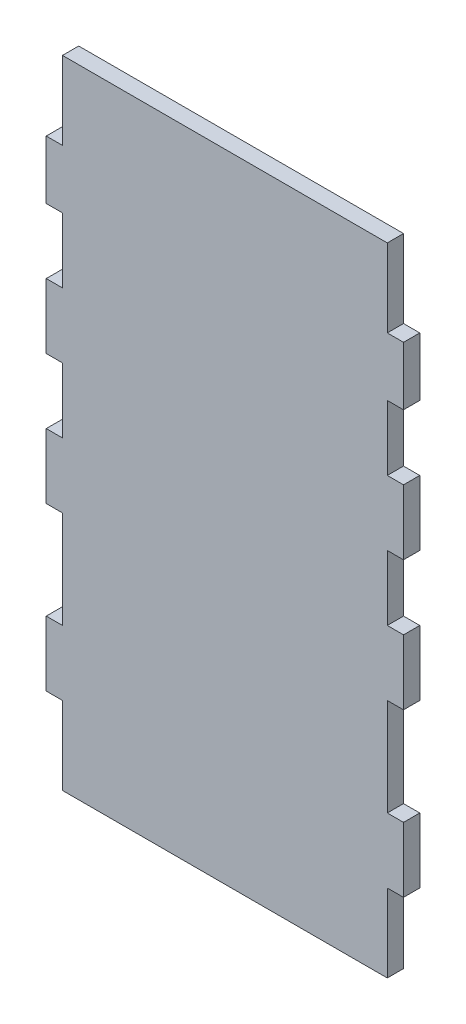
ISO-10303-21;
HEADER;
FILE_DESCRIPTION(('STEP AP214'),'2;1');
FILE_NAME('part.step','',(''),(''),'','','');
FILE_SCHEMA(('AUTOMOTIVE_DESIGN { 1 0 10303 214 1 1 1 1 }'));
ENDSEC;
DATA;
#1=APPLICATION_CONTEXT('core data for automotive mechanical design processes');
#2=APPLICATION_PROTOCOL_DEFINITION('international standard','automotive_design',2000,#1);
#3=PRODUCT_CONTEXT('',#1,'mechanical');
#4=PRODUCT('Part','Part','',(#3));
#5=PRODUCT_RELATED_PRODUCT_CATEGORY('part','',(#4));
#6=PRODUCT_DEFINITION_FORMATION('','',#4);
#7=PRODUCT_DEFINITION_CONTEXT('part definition',#1,'design');
#8=PRODUCT_DEFINITION('design','',#6,#7);
#9=PRODUCT_DEFINITION_SHAPE('','',#8);
#10=(LENGTH_UNIT() NAMED_UNIT(*) SI_UNIT(.MILLI.,.METRE.));
#11=(NAMED_UNIT(*) PLANE_ANGLE_UNIT() SI_UNIT($,.RADIAN.));
#12=(NAMED_UNIT(*) SI_UNIT($,.STERADIAN.) SOLID_ANGLE_UNIT());
#13=UNCERTAINTY_MEASURE_WITH_UNIT(LENGTH_MEASURE(1.E-05),#10,'distance_accuracy_value','');
#14=(GEOMETRIC_REPRESENTATION_CONTEXT(3) GLOBAL_UNCERTAINTY_ASSIGNED_CONTEXT((#13)) GLOBAL_UNIT_ASSIGNED_CONTEXT((#10,
#11,#12)) REPRESENTATION_CONTEXT('',''));
#15=CARTESIAN_POINT('',(0.,0.,0.));
#16=DIRECTION('',(0.,0.,1.));
#17=DIRECTION('',(1.,0.,0.));
#18=AXIS2_PLACEMENT_3D('',#15,#16,#17);
#19=CARTESIAN_POINT('',(-133.35,6.34999999999993,6.35));
#20=DIRECTION('',(1.,0.,0.));
#21=DIRECTION('',(0.,0.,-1.));
#22=AXIS2_PLACEMENT_3D('',#19,#20,#21);
#23=PLANE('',#22);
#24=DIRECTION('',(0.,-1.,0.));
#25=VECTOR('',#24,1.);
#26=CARTESIAN_POINT('',(-133.35,6.34999999999993,0.));
#27=LINE('',#26,#25);
#28=CARTESIAN_POINT('',(-133.35,58.42,0.));
#29=VERTEX_POINT('',#28);
#30=CARTESIAN_POINT('',(-133.35,33.02,0.));
#31=VERTEX_POINT('',#30);
#32=EDGE_CURVE('E310',#29,#31,#27,.T.);
#33=ORIENTED_EDGE('',*,*,#32,.T.);
#34=DIRECTION('',(0.,0.,-1.));
#35=VECTOR('',#34,1.);
#36=CARTESIAN_POINT('',(-133.35,33.02,6.35));
#37=LINE('',#36,#35);
#38=CARTESIAN_POINT('',(-133.35,33.02,6.35));
#39=VERTEX_POINT('',#38);
#40=EDGE_CURVE('E968',#39,#31,#37,.T.);
#41=ORIENTED_EDGE('',*,*,#40,.F.);
#42=DIRECTION('',(0.,-1.,0.));
#43=VECTOR('',#42,1.);
#44=CARTESIAN_POINT('',(-133.35,6.34999999999993,6.35));
#45=LINE('',#44,#43);
#46=CARTESIAN_POINT('',(-133.35,58.42,6.35));
#47=VERTEX_POINT('',#46);
#48=EDGE_CURVE('E301',#47,#39,#45,.T.);
#49=ORIENTED_EDGE('',*,*,#48,.F.);
#50=DIRECTION('',(0.,0.,-1.));
#51=VECTOR('',#50,1.);
#52=CARTESIAN_POINT('',(-133.35,58.42,6.35));
#53=LINE('',#52,#51);
#54=EDGE_CURVE('E951',#47,#29,#53,.T.);
#55=ORIENTED_EDGE('',*,*,#54,.T.);
#56=EDGE_LOOP('',(#33,#41,#49,#55));
#57=FACE_BOUND('',#56,.T.);
#58=ADVANCED_FACE('F38',(#57),#23,.F.);
#59=CARTESIAN_POINT('',(-133.35,121.92,0.));
#60=VERTEX_POINT('',#59);
#61=CARTESIAN_POINT('',(-133.35,96.52,0.));
#62=VERTEX_POINT('',#61);
#63=EDGE_CURVE('E312',#60,#62,#27,.T.);
#64=ORIENTED_EDGE('',*,*,#63,.T.);
#65=DIRECTION('',(0.,0.,-1.));
#66=VECTOR('',#65,1.);
#67=CARTESIAN_POINT('',(-133.35,96.52,6.35));
#68=LINE('',#67,#66);
#69=CARTESIAN_POINT('',(-133.35,96.52,6.35));
#70=VERTEX_POINT('',#69);
#71=EDGE_CURVE('E926',#70,#62,#68,.T.);
#72=ORIENTED_EDGE('',*,*,#71,.F.);
#73=CARTESIAN_POINT('',(-133.35,121.92,6.35));
#74=VERTEX_POINT('',#73);
#75=EDGE_CURVE('E304',#74,#70,#45,.T.);
#76=ORIENTED_EDGE('',*,*,#75,.F.);
#77=DIRECTION('',(0.,0.,-1.));
#78=VECTOR('',#77,1.);
#79=CARTESIAN_POINT('',(-133.35,121.92,6.35));
#80=LINE('',#79,#78);
#81=EDGE_CURVE('E360',#74,#60,#80,.T.);
#82=ORIENTED_EDGE('',*,*,#81,.T.);
#83=EDGE_LOOP('',(#64,#72,#76,#82));
#84=FACE_BOUND('',#83,.T.);
#85=ADVANCED_FACE('F559',(#84),#23,.F.);
#86=CARTESIAN_POINT('',(-133.35,172.72,0.));
#87=VERTEX_POINT('',#86);
#88=CARTESIAN_POINT('',(-133.35,147.32,0.));
#89=VERTEX_POINT('',#88);
#90=EDGE_CURVE('E318',#87,#89,#27,.T.);
#91=ORIENTED_EDGE('',*,*,#90,.T.);
#92=DIRECTION('',(0.,0.,-1.));
#93=VECTOR('',#92,1.);
#94=CARTESIAN_POINT('',(-133.35,147.32,6.35));
#95=LINE('',#94,#93);
#96=CARTESIAN_POINT('',(-133.35,147.32,6.35));
#97=VERTEX_POINT('',#96);
#98=EDGE_CURVE('E333',#97,#89,#95,.T.);
#99=ORIENTED_EDGE('',*,*,#98,.F.);
#100=CARTESIAN_POINT('',(-133.35,172.72,6.35));
#101=VERTEX_POINT('',#100);
#102=EDGE_CURVE('E914',#101,#97,#45,.T.);
#103=ORIENTED_EDGE('',*,*,#102,.F.);
#104=DIRECTION('',(0.,0.,-1.));
#105=VECTOR('',#104,1.);
#106=CARTESIAN_POINT('',(-133.35,172.72,6.35));
#107=LINE('',#106,#105);
#108=EDGE_CURVE('E335',#101,#87,#107,.T.);
#109=ORIENTED_EDGE('',*,*,#108,.T.);
#110=EDGE_LOOP('',(#91,#99,#103,#109));
#111=FACE_BOUND('',#110,.T.);
#112=ADVANCED_FACE('F331',(#111),#23,.F.);
#113=CARTESIAN_POINT('',(0.,0.,6.35));
#114=DIRECTION('',(0.,0.,1.));
#115=DIRECTION('',(1.,0.,0.));
#116=AXIS2_PLACEMENT_3D('',#113,#114,#115);
#117=PLANE('',#116);
#118=DIRECTION('',(1.,0.,0.));
#119=VECTOR('',#118,1.);
#120=CARTESIAN_POINT('',(-133.35,251.46,6.35));
#121=LINE('',#120,#119);
#122=CARTESIAN_POINT('',(-127.,251.46,6.35));
#123=VERTEX_POINT('',#122);
#124=CARTESIAN_POINT('',(0.,251.46,6.35));
#125=VERTEX_POINT('',#124);
#126=EDGE_CURVE('E268',#123,#125,#121,.T.);
#127=ORIENTED_EDGE('',*,*,#126,.F.);
#128=DIRECTION('',(0.,1.,0.));
#129=VECTOR('',#128,1.);
#130=CARTESIAN_POINT('',(-127.,0.,6.35));
#131=LINE('',#130,#129);
#132=CARTESIAN_POINT('',(-127.,220.98,6.35));
#133=VERTEX_POINT('',#132);
#134=EDGE_CURVE('E391',#133,#123,#131,.T.);
#135=ORIENTED_EDGE('',*,*,#134,.F.);
#136=DIRECTION('',(-1.,0.,0.));
#137=VECTOR('',#136,1.);
#138=CARTESIAN_POINT('',(0.,220.98,6.35));
#139=LINE('',#138,#137);
#140=CARTESIAN_POINT('',(-133.35,220.98,6.35));
#141=VERTEX_POINT('',#140);
#142=EDGE_CURVE('E393',#133,#141,#139,.T.);
#143=ORIENTED_EDGE('',*,*,#142,.T.);
#144=CARTESIAN_POINT('',(-133.35,198.12,6.35));
#145=VERTEX_POINT('',#144);
#146=EDGE_CURVE('E46',#141,#145,#45,.T.);
#147=ORIENTED_EDGE('',*,*,#146,.T.);
#148=DIRECTION('',(1.,0.,0.));
#149=VECTOR('',#148,1.);
#150=CARTESIAN_POINT('',(0.,198.12,6.35));
#151=LINE('',#150,#149);
#152=CARTESIAN_POINT('',(-127.,198.12,6.35));
#153=VERTEX_POINT('',#152);
#154=EDGE_CURVE('E369',#145,#153,#151,.T.);
#155=ORIENTED_EDGE('',*,*,#154,.T.);
#156=DIRECTION('',(0.,-1.,0.));
#157=VECTOR('',#156,1.);
#158=CARTESIAN_POINT('',(-127.,0.,6.35));
#159=LINE('',#158,#157);
#160=CARTESIAN_POINT('',(-127.,172.72,6.35));
#161=VERTEX_POINT('',#160);
#162=EDGE_CURVE('E372',#153,#161,#159,.T.);
#163=ORIENTED_EDGE('',*,*,#162,.T.);
#164=DIRECTION('',(-1.,0.,0.));
#165=VECTOR('',#164,1.);
#166=CARTESIAN_POINT('',(0.,172.72,6.35));
#167=LINE('',#166,#165);
#168=EDGE_CURVE('E375',#161,#101,#167,.T.);
#169=ORIENTED_EDGE('',*,*,#168,.T.);
#170=ORIENTED_EDGE('',*,*,#102,.T.);
#171=DIRECTION('',(1.,0.,0.));
#172=VECTOR('',#171,1.);
#173=CARTESIAN_POINT('',(0.,147.32,6.35));
#174=LINE('',#173,#172);
#175=CARTESIAN_POINT('',(-127.,147.32,6.35));
#176=VERTEX_POINT('',#175);
#177=EDGE_CURVE('E359',#97,#176,#174,.T.);
#178=ORIENTED_EDGE('',*,*,#177,.T.);
#179=DIRECTION('',(0.,-1.,0.));
#180=VECTOR('',#179,1.);
#181=CARTESIAN_POINT('',(-127.,0.,6.35));
#182=LINE('',#181,#180);
#183=CARTESIAN_POINT('',(-127.,121.92,6.35));
#184=VERTEX_POINT('',#183);
#185=EDGE_CURVE('E939',#176,#184,#182,.T.);
#186=ORIENTED_EDGE('',*,*,#185,.T.);
#187=DIRECTION('',(-1.,0.,0.));
#188=VECTOR('',#187,1.);
#189=CARTESIAN_POINT('',(0.,121.92,6.35));
#190=LINE('',#189,#188);
#191=EDGE_CURVE('E355',#184,#74,#190,.T.);
#192=ORIENTED_EDGE('',*,*,#191,.T.);
#193=ORIENTED_EDGE('',*,*,#75,.T.);
#194=DIRECTION('',(1.,0.,0.));
#195=VECTOR('',#194,1.);
#196=CARTESIAN_POINT('',(0.,96.52,6.35));
#197=LINE('',#196,#195);
#198=CARTESIAN_POINT('',(-127.,96.52,6.35));
#199=VERTEX_POINT('',#198);
#200=EDGE_CURVE('E921',#70,#199,#197,.T.);
#201=ORIENTED_EDGE('',*,*,#200,.T.);
#202=DIRECTION('',(0.,-1.,0.));
#203=VECTOR('',#202,1.);
#204=CARTESIAN_POINT('',(-127.,0.,6.35));
#205=LINE('',#204,#203);
#206=CARTESIAN_POINT('',(-127.,58.42,6.35));
#207=VERTEX_POINT('',#206);
#208=EDGE_CURVE('E935',#199,#207,#205,.T.);
#209=ORIENTED_EDGE('',*,*,#208,.T.);
#210=DIRECTION('',(-1.,0.,0.));
#211=VECTOR('',#210,1.);
#212=CARTESIAN_POINT('',(0.,58.42,6.35));
#213=LINE('',#212,#211);
#214=EDGE_CURVE('E930',#207,#47,#213,.T.);
#215=ORIENTED_EDGE('',*,*,#214,.T.);
#216=ORIENTED_EDGE('',*,*,#48,.T.);
#217=DIRECTION('',(1.,0.,0.));
#218=VECTOR('',#217,1.);
#219=CARTESIAN_POINT('',(0.,33.02,6.35));
#220=LINE('',#219,#218);
#221=CARTESIAN_POINT('',(-127.,33.02,6.35));
#222=VERTEX_POINT('',#221);
#223=EDGE_CURVE('E961',#39,#222,#220,.T.);
#224=ORIENTED_EDGE('',*,*,#223,.T.);
#225=DIRECTION('',(0.,-1.,0.));
#226=VECTOR('',#225,1.);
#227=CARTESIAN_POINT('',(-127.,0.,6.35));
#228=LINE('',#227,#226);
#229=CARTESIAN_POINT('',(-127.,2.53999999999993,6.35));
#230=VERTEX_POINT('',#229);
#231=EDGE_CURVE('E964',#222,#230,#228,.T.);
#232=ORIENTED_EDGE('',*,*,#231,.T.);
#233=DIRECTION('',(-1.,0.,0.));
#234=VECTOR('',#233,1.);
#235=CARTESIAN_POINT('',(0.,2.53999999999995,6.35));
#236=LINE('',#235,#234);
#237=CARTESIAN_POINT('',(0.,2.53999999999995,6.35));
#238=VERTEX_POINT('',#237);
#239=EDGE_CURVE('E979',#238,#230,#236,.T.);
#240=ORIENTED_EDGE('',*,*,#239,.F.);
#241=DIRECTION('',(0.,-1.,0.));
#242=VECTOR('',#241,1.);
#243=CARTESIAN_POINT('',(0.,6.34999999999995,6.35));
#244=LINE('',#243,#242);
#245=CARTESIAN_POINT('',(0.,33.02,6.35));
#246=VERTEX_POINT('',#245);
#247=EDGE_CURVE('E403',#246,#238,#244,.T.);
#248=ORIENTED_EDGE('',*,*,#247,.F.);
#249=DIRECTION('',(1.,0.,0.));
#250=VECTOR('',#249,1.);
#251=CARTESIAN_POINT('',(0.,33.02,6.35));
#252=LINE('',#251,#250);
#253=CARTESIAN_POINT('',(6.35,33.02,6.35));
#254=VERTEX_POINT('',#253);
#255=EDGE_CURVE('E308',#246,#254,#252,.T.);
#256=ORIENTED_EDGE('',*,*,#255,.T.);
#257=DIRECTION('',(0.,1.,0.));
#258=VECTOR('',#257,1.);
#259=CARTESIAN_POINT('',(6.35,6.34999999999995,6.35));
#260=LINE('',#259,#258);
#261=CARTESIAN_POINT('',(6.35,58.42,6.35));
#262=VERTEX_POINT('',#261);
#263=EDGE_CURVE('E300',#254,#262,#260,.T.);
#264=ORIENTED_EDGE('',*,*,#263,.T.);
#265=DIRECTION('',(1.,0.,0.));
#266=VECTOR('',#265,1.);
#267=CARTESIAN_POINT('',(0.,58.42,6.35));
#268=LINE('',#267,#266);
#269=CARTESIAN_POINT('',(0.,58.42,6.35));
#270=VERTEX_POINT('',#269);
#271=EDGE_CURVE('E417',#270,#262,#268,.T.);
#272=ORIENTED_EDGE('',*,*,#271,.F.);
#273=DIRECTION('',(0.,-1.,0.));
#274=VECTOR('',#273,1.);
#275=CARTESIAN_POINT('',(0.,58.42,6.35));
#276=LINE('',#275,#274);
#277=CARTESIAN_POINT('',(0.,96.52,6.35));
#278=VERTEX_POINT('',#277);
#279=EDGE_CURVE('E431',#278,#270,#276,.T.);
#280=ORIENTED_EDGE('',*,*,#279,.F.);
#281=DIRECTION('',(1.,0.,0.));
#282=VECTOR('',#281,1.);
#283=CARTESIAN_POINT('',(0.,96.52,6.35));
#284=LINE('',#283,#282);
#285=CARTESIAN_POINT('',(6.35,96.52,6.35));
#286=VERTEX_POINT('',#285);
#287=EDGE_CURVE('E425',#278,#286,#284,.T.);
#288=ORIENTED_EDGE('',*,*,#287,.T.);
#289=CARTESIAN_POINT('',(6.35,121.92,6.35));
#290=VERTEX_POINT('',#289);
#291=EDGE_CURVE('E537',#286,#290,#260,.T.);
#292=ORIENTED_EDGE('',*,*,#291,.T.);
#293=DIRECTION('',(1.,0.,0.));
#294=VECTOR('',#293,1.);
#295=CARTESIAN_POINT('',(0.,121.92,6.35));
#296=LINE('',#295,#294);
#297=CARTESIAN_POINT('',(0.,121.92,6.35));
#298=VERTEX_POINT('',#297);
#299=EDGE_CURVE('E441',#298,#290,#296,.T.);
#300=ORIENTED_EDGE('',*,*,#299,.F.);
#301=DIRECTION('',(0.,-1.,0.));
#302=VECTOR('',#301,1.);
#303=CARTESIAN_POINT('',(0.,121.92,6.35));
#304=LINE('',#303,#302);
#305=CARTESIAN_POINT('',(0.,147.32,6.35));
#306=VERTEX_POINT('',#305);
#307=EDGE_CURVE('E455',#306,#298,#304,.T.);
#308=ORIENTED_EDGE('',*,*,#307,.F.);
#309=DIRECTION('',(1.,0.,0.));
#310=VECTOR('',#309,1.);
#311=CARTESIAN_POINT('',(0.,147.32,6.35));
#312=LINE('',#311,#310);
#313=CARTESIAN_POINT('',(6.35,147.32,6.35));
#314=VERTEX_POINT('',#313);
#315=EDGE_CURVE('E449',#306,#314,#312,.T.);
#316=ORIENTED_EDGE('',*,*,#315,.T.);
#317=CARTESIAN_POINT('',(6.35,172.72,6.35));
#318=VERTEX_POINT('',#317);
#319=EDGE_CURVE('E298',#314,#318,#260,.T.);
#320=ORIENTED_EDGE('',*,*,#319,.T.);
#321=DIRECTION('',(1.,0.,0.));
#322=VECTOR('',#321,1.);
#323=CARTESIAN_POINT('',(0.,172.72,6.35));
#324=LINE('',#323,#322);
#325=CARTESIAN_POINT('',(0.,172.72,6.35));
#326=VERTEX_POINT('',#325);
#327=EDGE_CURVE('E465',#326,#318,#324,.T.);
#328=ORIENTED_EDGE('',*,*,#327,.F.);
#329=DIRECTION('',(0.,-1.,0.));
#330=VECTOR('',#329,1.);
#331=CARTESIAN_POINT('',(0.,172.72,6.35));
#332=LINE('',#331,#330);
#333=CARTESIAN_POINT('',(0.,198.12,6.35));
#334=VERTEX_POINT('',#333);
#335=EDGE_CURVE('E478',#334,#326,#332,.T.);
#336=ORIENTED_EDGE('',*,*,#335,.F.);
#337=DIRECTION('',(1.,0.,0.));
#338=VECTOR('',#337,1.);
#339=CARTESIAN_POINT('',(0.,198.12,6.35));
#340=LINE('',#339,#338);
#341=CARTESIAN_POINT('',(6.35,198.12,6.35));
#342=VERTEX_POINT('',#341);
#343=EDGE_CURVE('E473',#334,#342,#340,.T.);
#344=ORIENTED_EDGE('',*,*,#343,.T.);
#345=CARTESIAN_POINT('',(6.35,220.98,6.35));
#346=VERTEX_POINT('',#345);
#347=EDGE_CURVE('E296',#342,#346,#260,.T.);
#348=ORIENTED_EDGE('',*,*,#347,.T.);
#349=DIRECTION('',(1.,0.,0.));
#350=VECTOR('',#349,1.);
#351=CARTESIAN_POINT('',(0.,220.98,6.35));
#352=LINE('',#351,#350);
#353=CARTESIAN_POINT('',(0.,220.98,6.35));
#354=VERTEX_POINT('',#353);
#355=EDGE_CURVE('E288',#354,#346,#352,.T.);
#356=ORIENTED_EDGE('',*,*,#355,.F.);
#357=DIRECTION('',(0.,-1.,0.));
#358=VECTOR('',#357,1.);
#359=CARTESIAN_POINT('',(0.,220.98,6.35));
#360=LINE('',#359,#358);
#361=EDGE_CURVE('E280',#125,#354,#360,.T.);
#362=ORIENTED_EDGE('',*,*,#361,.F.);
#363=EDGE_LOOP('',(#127,#135,#143,#147,#155,#163,#169,#170,#178,#186,#192,#193,#201,#209,#215,
#216,#224,#232,#240,#248,#256,#264,#272,#280,#288,#292,#300,#308,#316,#320,#328,#336,#344,#348,
#356,#362));
#364=FACE_BOUND('',#363,.T.);
#365=ADVANCED_FACE('F286',(#364),#117,.T.);
#366=CARTESIAN_POINT('',(0.,0.,0.));
#367=DIRECTION('',(0.,0.,1.));
#368=DIRECTION('',(1.,0.,0.));
#369=AXIS2_PLACEMENT_3D('',#366,#367,#368);
#370=PLANE('',#369);
#371=DIRECTION('',(0.,1.,0.));
#372=VECTOR('',#371,1.);
#373=CARTESIAN_POINT('',(-127.,0.,0.));
#374=LINE('',#373,#372);
#375=CARTESIAN_POINT('',(-127.,220.98,0.));
#376=VERTEX_POINT('',#375);
#377=CARTESIAN_POINT('',(-127.,251.46,0.));
#378=VERTEX_POINT('',#377);
#379=EDGE_CURVE('E59',#376,#378,#374,.T.);
#380=ORIENTED_EDGE('',*,*,#379,.T.);
#381=DIRECTION('',(1.,0.,0.));
#382=VECTOR('',#381,1.);
#383=CARTESIAN_POINT('',(-133.35,251.46,0.));
#384=LINE('',#383,#382);
#385=CARTESIAN_POINT('',(0.,251.46,0.));
#386=VERTEX_POINT('',#385);
#387=EDGE_CURVE('E52',#378,#386,#384,.T.);
#388=ORIENTED_EDGE('',*,*,#387,.T.);
#389=DIRECTION('',(0.,1.,0.));
#390=VECTOR('',#389,1.);
#391=CARTESIAN_POINT('',(0.,220.98,0.));
#392=LINE('',#391,#390);
#393=CARTESIAN_POINT('',(0.,220.98,0.));
#394=VERTEX_POINT('',#393);
#395=EDGE_CURVE('E283',#394,#386,#392,.T.);
#396=ORIENTED_EDGE('',*,*,#395,.F.);
#397=DIRECTION('',(1.,0.,0.));
#398=VECTOR('',#397,1.);
#399=CARTESIAN_POINT('',(0.,220.98,0.));
#400=LINE('',#399,#398);
#401=CARTESIAN_POINT('',(6.35,220.98,0.));
#402=VERTEX_POINT('',#401);
#403=EDGE_CURVE('E489',#394,#402,#400,.T.);
#404=ORIENTED_EDGE('',*,*,#403,.T.);
#405=DIRECTION('',(0.,1.,0.));
#406=VECTOR('',#405,1.);
#407=CARTESIAN_POINT('',(6.35,6.34999999999995,0.));
#408=LINE('',#407,#406);
#409=CARTESIAN_POINT('',(6.35,198.12,0.));
#410=VERTEX_POINT('',#409);
#411=EDGE_CURVE('E305',#410,#402,#408,.T.);
#412=ORIENTED_EDGE('',*,*,#411,.F.);
#413=DIRECTION('',(1.,0.,0.));
#414=VECTOR('',#413,1.);
#415=CARTESIAN_POINT('',(0.,198.12,0.));
#416=LINE('',#415,#414);
#417=CARTESIAN_POINT('',(0.,198.12,0.));
#418=VERTEX_POINT('',#417);
#419=EDGE_CURVE('E471',#418,#410,#416,.T.);
#420=ORIENTED_EDGE('',*,*,#419,.F.);
#421=DIRECTION('',(0.,1.,0.));
#422=VECTOR('',#421,1.);
#423=CARTESIAN_POINT('',(0.,172.72,0.));
#424=LINE('',#423,#422);
#425=CARTESIAN_POINT('',(0.,172.72,0.));
#426=VERTEX_POINT('',#425);
#427=EDGE_CURVE('E482',#426,#418,#424,.T.);
#428=ORIENTED_EDGE('',*,*,#427,.F.);
#429=DIRECTION('',(1.,0.,0.));
#430=VECTOR('',#429,1.);
#431=CARTESIAN_POINT('',(0.,172.72,0.));
#432=LINE('',#431,#430);
#433=CARTESIAN_POINT('',(6.35,172.72,0.));
#434=VERTEX_POINT('',#433);
#435=EDGE_CURVE('E468',#426,#434,#432,.T.);
#436=ORIENTED_EDGE('',*,*,#435,.T.);
#437=CARTESIAN_POINT('',(6.35,147.32,0.));
#438=VERTEX_POINT('',#437);
#439=EDGE_CURVE('E307',#438,#434,#408,.T.);
#440=ORIENTED_EDGE('',*,*,#439,.F.);
#441=DIRECTION('',(1.,0.,0.));
#442=VECTOR('',#441,1.);
#443=CARTESIAN_POINT('',(0.,147.32,0.));
#444=LINE('',#443,#442);
#445=CARTESIAN_POINT('',(0.,147.32,0.));
#446=VERTEX_POINT('',#445);
#447=EDGE_CURVE('E447',#446,#438,#444,.T.);
#448=ORIENTED_EDGE('',*,*,#447,.F.);
#449=DIRECTION('',(0.,1.,0.));
#450=VECTOR('',#449,1.);
#451=CARTESIAN_POINT('',(0.,121.92,0.));
#452=LINE('',#451,#450);
#453=CARTESIAN_POINT('',(0.,121.92,0.));
#454=VERTEX_POINT('',#453);
#455=EDGE_CURVE('E459',#454,#446,#452,.T.);
#456=ORIENTED_EDGE('',*,*,#455,.F.);
#457=DIRECTION('',(1.,0.,0.));
#458=VECTOR('',#457,1.);
#459=CARTESIAN_POINT('',(0.,121.92,0.));
#460=LINE('',#459,#458);
#461=CARTESIAN_POINT('',(6.35,121.92,0.));
#462=VERTEX_POINT('',#461);
#463=EDGE_CURVE('E444',#454,#462,#460,.T.);
#464=ORIENTED_EDGE('',*,*,#463,.T.);
#465=CARTESIAN_POINT('',(6.35,96.52,0.));
#466=VERTEX_POINT('',#465);
#467=EDGE_CURVE('E320',#466,#462,#408,.T.);
#468=ORIENTED_EDGE('',*,*,#467,.F.);
#469=DIRECTION('',(1.,0.,0.));
#470=VECTOR('',#469,1.);
#471=CARTESIAN_POINT('',(0.,96.52,0.));
#472=LINE('',#471,#470);
#473=CARTESIAN_POINT('',(0.,96.52,0.));
#474=VERTEX_POINT('',#473);
#475=EDGE_CURVE('E423',#474,#466,#472,.T.);
#476=ORIENTED_EDGE('',*,*,#475,.F.);
#477=DIRECTION('',(0.,1.,0.));
#478=VECTOR('',#477,1.);
#479=CARTESIAN_POINT('',(0.,58.42,0.));
#480=LINE('',#479,#478);
#481=CARTESIAN_POINT('',(0.,58.42,0.));
#482=VERTEX_POINT('',#481);
#483=EDGE_CURVE('E435',#482,#474,#480,.T.);
#484=ORIENTED_EDGE('',*,*,#483,.F.);
#485=DIRECTION('',(1.,0.,0.));
#486=VECTOR('',#485,1.);
#487=CARTESIAN_POINT('',(0.,58.42,0.));
#488=LINE('',#487,#486);
#489=CARTESIAN_POINT('',(6.35,58.42,0.));
#490=VERTEX_POINT('',#489);
#491=EDGE_CURVE('E420',#482,#490,#488,.T.);
#492=ORIENTED_EDGE('',*,*,#491,.T.);
#493=CARTESIAN_POINT('',(6.35,33.02,0.));
#494=VERTEX_POINT('',#493);
#495=EDGE_CURVE('E309',#494,#490,#408,.T.);
#496=ORIENTED_EDGE('',*,*,#495,.F.);
#497=DIRECTION('',(1.,0.,0.));
#498=VECTOR('',#497,1.);
#499=CARTESIAN_POINT('',(0.,33.02,0.));
#500=LINE('',#499,#498);
#501=CARTESIAN_POINT('',(0.,33.02,0.));
#502=VERTEX_POINT('',#501);
#503=EDGE_CURVE('E411',#502,#494,#500,.T.);
#504=ORIENTED_EDGE('',*,*,#503,.F.);
#505=DIRECTION('',(0.,1.,0.));
#506=VECTOR('',#505,1.);
#507=CARTESIAN_POINT('',(0.,6.34999999999995,0.));
#508=LINE('',#507,#506);
#509=CARTESIAN_POINT('',(0.,2.53999999999995,0.));
#510=VERTEX_POINT('',#509);
#511=EDGE_CURVE('E405',#510,#502,#508,.T.);
#512=ORIENTED_EDGE('',*,*,#511,.F.);
#513=DIRECTION('',(1.,0.,0.));
#514=VECTOR('',#513,1.);
#515=CARTESIAN_POINT('',(-127.,2.53999999999993,0.));
#516=LINE('',#515,#514);
#517=CARTESIAN_POINT('',(-127.,2.53999999999993,0.));
#518=VERTEX_POINT('',#517);
#519=EDGE_CURVE('E399',#518,#510,#516,.T.);
#520=ORIENTED_EDGE('',*,*,#519,.F.);
#521=DIRECTION('',(0.,-1.,0.));
#522=VECTOR('',#521,1.);
#523=CARTESIAN_POINT('',(-127.,0.,0.));
#524=LINE('',#523,#522);
#525=CARTESIAN_POINT('',(-127.,33.02,0.));
#526=VERTEX_POINT('',#525);
#527=EDGE_CURVE('E959',#526,#518,#524,.T.);
#528=ORIENTED_EDGE('',*,*,#527,.F.);
#529=DIRECTION('',(1.,0.,0.));
#530=VECTOR('',#529,1.);
#531=CARTESIAN_POINT('',(0.,33.02,0.));
#532=LINE('',#531,#530);
#533=EDGE_CURVE('E952',#31,#526,#532,.T.);
#534=ORIENTED_EDGE('',*,*,#533,.F.);
#535=ORIENTED_EDGE('',*,*,#32,.F.);
#536=DIRECTION('',(-1.,0.,0.));
#537=VECTOR('',#536,1.);
#538=CARTESIAN_POINT('',(0.,58.42,0.));
#539=LINE('',#538,#537);
#540=CARTESIAN_POINT('',(-127.,58.42,0.));
#541=VERTEX_POINT('',#540);
#542=EDGE_CURVE('E946',#541,#29,#539,.T.);
#543=ORIENTED_EDGE('',*,*,#542,.F.);
#544=DIRECTION('',(0.,-1.,0.));
#545=VECTOR('',#544,1.);
#546=CARTESIAN_POINT('',(-127.,0.,0.));
#547=LINE('',#546,#545);
#548=CARTESIAN_POINT('',(-127.,96.52,0.));
#549=VERTEX_POINT('',#548);
#550=EDGE_CURVE('E944',#549,#541,#547,.T.);
#551=ORIENTED_EDGE('',*,*,#550,.F.);
#552=DIRECTION('',(1.,0.,0.));
#553=VECTOR('',#552,1.);
#554=CARTESIAN_POINT('',(0.,96.52,0.));
#555=LINE('',#554,#553);
#556=EDGE_CURVE('E363',#62,#549,#555,.T.);
#557=ORIENTED_EDGE('',*,*,#556,.F.);
#558=ORIENTED_EDGE('',*,*,#63,.F.);
#559=DIRECTION('',(-1.,0.,0.));
#560=VECTOR('',#559,1.);
#561=CARTESIAN_POINT('',(0.,121.92,0.));
#562=LINE('',#561,#560);
#563=CARTESIAN_POINT('',(-127.,121.92,0.));
#564=VERTEX_POINT('',#563);
#565=EDGE_CURVE('E350',#564,#60,#562,.T.);
#566=ORIENTED_EDGE('',*,*,#565,.F.);
#567=DIRECTION('',(0.,-1.,0.));
#568=VECTOR('',#567,1.);
#569=CARTESIAN_POINT('',(-127.,0.,0.));
#570=LINE('',#569,#568);
#571=CARTESIAN_POINT('',(-127.,147.32,0.));
#572=VERTEX_POINT('',#571);
#573=EDGE_CURVE('E347',#572,#564,#570,.T.);
#574=ORIENTED_EDGE('',*,*,#573,.F.);
#575=DIRECTION('',(1.,0.,0.));
#576=VECTOR('',#575,1.);
#577=CARTESIAN_POINT('',(0.,147.32,0.));
#578=LINE('',#577,#576);
#579=EDGE_CURVE('E344',#89,#572,#578,.T.);
#580=ORIENTED_EDGE('',*,*,#579,.F.);
#581=ORIENTED_EDGE('',*,*,#90,.F.);
#582=DIRECTION('',(-1.,0.,0.));
#583=VECTOR('',#582,1.);
#584=CARTESIAN_POINT('',(0.,172.72,0.));
#585=LINE('',#584,#583);
#586=CARTESIAN_POINT('',(-127.,172.72,0.));
#587=VERTEX_POINT('',#586);
#588=EDGE_CURVE('E341',#587,#87,#585,.T.);
#589=ORIENTED_EDGE('',*,*,#588,.F.);
#590=DIRECTION('',(0.,-1.,0.));
#591=VECTOR('',#590,1.);
#592=CARTESIAN_POINT('',(-127.,0.,0.));
#593=LINE('',#592,#591);
#594=CARTESIAN_POINT('',(-127.,198.12,0.));
#595=VERTEX_POINT('',#594);
#596=EDGE_CURVE('E382',#595,#587,#593,.T.);
#597=ORIENTED_EDGE('',*,*,#596,.F.);
#598=DIRECTION('',(1.,0.,0.));
#599=VECTOR('',#598,1.);
#600=CARTESIAN_POINT('',(0.,198.12,0.));
#601=LINE('',#600,#599);
#602=CARTESIAN_POINT('',(-133.35,198.12,0.));
#603=VERTEX_POINT('',#602);
#604=EDGE_CURVE('E379',#603,#595,#601,.T.);
#605=ORIENTED_EDGE('',*,*,#604,.F.);
#606=CARTESIAN_POINT('',(-133.35,220.98,0.));
#607=VERTEX_POINT('',#606);
#608=EDGE_CURVE('E299',#607,#603,#27,.T.);
#609=ORIENTED_EDGE('',*,*,#608,.F.);
#610=DIRECTION('',(-1.,0.,0.));
#611=VECTOR('',#610,1.);
#612=CARTESIAN_POINT('',(0.,220.98,0.));
#613=LINE('',#612,#611);
#614=EDGE_CURVE('E394',#376,#607,#613,.T.);
#615=ORIENTED_EDGE('',*,*,#614,.F.);
#616=EDGE_LOOP('',(#380,#388,#396,#404,#412,#420,#428,#436,#440,#448,#456,#464,#468,#476,#484,
#492,#496,#504,#512,#520,#528,#534,#535,#543,#551,#557,#558,#566,#574,#580,#581,#589,#597,#605,
#609,#615));
#617=FACE_BOUND('',#616,.T.);
#618=ADVANCED_FACE('F339',(#617),#370,.F.);
#619=CARTESIAN_POINT('',(6.35,6.34999999999995,6.35));
#620=DIRECTION('',(-1.,0.,0.));
#621=DIRECTION('',(0.,0.,1.));
#622=AXIS2_PLACEMENT_3D('',#619,#620,#621);
#623=PLANE('',#622);
#624=ORIENTED_EDGE('',*,*,#291,.F.);
#625=DIRECTION('',(0.,0.,1.));
#626=VECTOR('',#625,1.);
#627=CARTESIAN_POINT('',(6.35,96.52,6.35));
#628=LINE('',#627,#626);
#629=EDGE_CURVE('E429',#466,#286,#628,.T.);
#630=ORIENTED_EDGE('',*,*,#629,.F.);
#631=ORIENTED_EDGE('',*,*,#467,.T.);
#632=DIRECTION('',(0.,0.,-1.));
#633=VECTOR('',#632,1.);
#634=CARTESIAN_POINT('',(6.35,121.92,6.35));
#635=LINE('',#634,#633);
#636=EDGE_CURVE('E428',#290,#462,#635,.T.);
#637=ORIENTED_EDGE('',*,*,#636,.F.);
#638=EDGE_LOOP('',(#624,#630,#631,#637));
#639=FACE_BOUND('',#638,.T.);
#640=ADVANCED_FACE('F527',(#639),#623,.F.);
#641=ORIENTED_EDGE('',*,*,#319,.F.);
#642=DIRECTION('',(0.,0.,1.));
#643=VECTOR('',#642,1.);
#644=CARTESIAN_POINT('',(6.35,147.32,6.35));
#645=LINE('',#644,#643);
#646=EDGE_CURVE('E453',#438,#314,#645,.T.);
#647=ORIENTED_EDGE('',*,*,#646,.F.);
#648=ORIENTED_EDGE('',*,*,#439,.T.);
#649=DIRECTION('',(0.,0.,-1.));
#650=VECTOR('',#649,1.);
#651=CARTESIAN_POINT('',(6.35,172.72,6.35));
#652=LINE('',#651,#650);
#653=EDGE_CURVE('E452',#318,#434,#652,.T.);
#654=ORIENTED_EDGE('',*,*,#653,.F.);
#655=EDGE_LOOP('',(#641,#647,#648,#654));
#656=FACE_BOUND('',#655,.T.);
#657=ADVANCED_FACE('F520',(#656),#623,.F.);
#658=ORIENTED_EDGE('',*,*,#347,.F.);
#659=DIRECTION('',(0.,0.,1.));
#660=VECTOR('',#659,1.);
#661=CARTESIAN_POINT('',(6.35,198.12,6.35));
#662=LINE('',#661,#660);
#663=EDGE_CURVE('E476',#410,#342,#662,.T.);
#664=ORIENTED_EDGE('',*,*,#663,.F.);
#665=ORIENTED_EDGE('',*,*,#411,.T.);
#666=DIRECTION('',(0.,0.,-1.));
#667=VECTOR('',#666,1.);
#668=CARTESIAN_POINT('',(6.35,220.98,0.));
#669=LINE('',#668,#667);
#670=EDGE_CURVE('E291',#346,#402,#669,.T.);
#671=ORIENTED_EDGE('',*,*,#670,.F.);
#672=EDGE_LOOP('',(#658,#664,#665,#671));
#673=FACE_BOUND('',#672,.T.);
#674=ADVANCED_FACE('F501',(#673),#623,.F.);
#675=ORIENTED_EDGE('',*,*,#263,.F.);
#676=DIRECTION('',(0.,0.,1.));
#677=VECTOR('',#676,1.);
#678=CARTESIAN_POINT('',(6.35,33.02,6.35));
#679=LINE('',#678,#677);
#680=EDGE_CURVE('E406',#494,#254,#679,.T.);
#681=ORIENTED_EDGE('',*,*,#680,.F.);
#682=ORIENTED_EDGE('',*,*,#495,.T.);
#683=DIRECTION('',(0.,0.,-1.));
#684=VECTOR('',#683,1.);
#685=CARTESIAN_POINT('',(6.35,58.42,6.35));
#686=LINE('',#685,#684);
#687=EDGE_CURVE('E413',#262,#490,#686,.T.);
#688=ORIENTED_EDGE('',*,*,#687,.F.);
#689=EDGE_LOOP('',(#675,#681,#682,#688));
#690=FACE_BOUND('',#689,.T.);
#691=ADVANCED_FACE('F40',(#690),#623,.F.);
#692=ORIENTED_EDGE('',*,*,#608,.T.);
#693=DIRECTION('',(0.,0.,-1.));
#694=VECTOR('',#693,1.);
#695=CARTESIAN_POINT('',(-133.35,198.12,6.35));
#696=LINE('',#695,#694);
#697=EDGE_CURVE('E378',#145,#603,#696,.T.);
#698=ORIENTED_EDGE('',*,*,#697,.F.);
#699=ORIENTED_EDGE('',*,*,#146,.F.);
#700=DIRECTION('',(0.,0.,-1.));
#701=VECTOR('',#700,1.);
#702=CARTESIAN_POINT('',(-133.35,220.98,6.35));
#703=LINE('',#702,#701);
#704=EDGE_CURVE('E383',#141,#607,#703,.T.);
#705=ORIENTED_EDGE('',*,*,#704,.T.);
#706=EDGE_LOOP('',(#692,#698,#699,#705));
#707=FACE_BOUND('',#706,.T.);
#708=ADVANCED_FACE('F560',(#707),#23,.F.);
#709=CARTESIAN_POINT('',(0.,220.98,0.));
#710=DIRECTION('',(0.,-1.,0.));
#711=DIRECTION('',(0.,0.,-1.));
#712=AXIS2_PLACEMENT_3D('',#709,#710,#711);
#713=PLANE('',#712);
#714=ORIENTED_EDGE('',*,*,#670,.T.);
#715=ORIENTED_EDGE('',*,*,#403,.F.);
#716=DIRECTION('',(0.,0.,-1.));
#717=VECTOR('',#716,1.);
#718=CARTESIAN_POINT('',(0.,220.98,0.));
#719=LINE('',#718,#717);
#720=EDGE_CURVE('E289',#354,#394,#719,.T.);
#721=ORIENTED_EDGE('',*,*,#720,.F.);
#722=ORIENTED_EDGE('',*,*,#355,.T.);
#723=EDGE_LOOP('',(#714,#715,#721,#722));
#724=FACE_BOUND('',#723,.T.);
#725=ADVANCED_FACE('F495',(#724),#713,.F.);
#726=CARTESIAN_POINT('',(0.,0.,0.));
#727=DIRECTION('',(1.,0.,0.));
#728=DIRECTION('',(0.,0.,-1.));
#729=AXIS2_PLACEMENT_3D('',#726,#727,#728);
#730=PLANE('',#729);
#731=DIRECTION('',(0.,0.,-1.));
#732=VECTOR('',#731,1.);
#733=CARTESIAN_POINT('',(0.,251.46,0.));
#734=LINE('',#733,#732);
#735=EDGE_CURVE('E271',#125,#386,#734,.T.);
#736=ORIENTED_EDGE('',*,*,#735,.F.);
#737=ORIENTED_EDGE('',*,*,#361,.T.);
#738=ORIENTED_EDGE('',*,*,#720,.T.);
#739=ORIENTED_EDGE('',*,*,#395,.T.);
#740=EDGE_LOOP('',(#736,#737,#738,#739));
#741=FACE_BOUND('',#740,.T.);
#742=ADVANCED_FACE('F279',(#741),#730,.T.);
#743=CARTESIAN_POINT('',(0.,198.12,6.35));
#744=DIRECTION('',(0.,1.,0.));
#745=DIRECTION('',(0.,0.,1.));
#746=AXIS2_PLACEMENT_3D('',#743,#744,#745);
#747=PLANE('',#746);
#748=ORIENTED_EDGE('',*,*,#663,.T.);
#749=ORIENTED_EDGE('',*,*,#343,.F.);
#750=DIRECTION('',(0.,0.,1.));
#751=VECTOR('',#750,1.);
#752=CARTESIAN_POINT('',(0.,198.12,6.35));
#753=LINE('',#752,#751);
#754=EDGE_CURVE('E467',#418,#334,#753,.T.);
#755=ORIENTED_EDGE('',*,*,#754,.F.);
#756=ORIENTED_EDGE('',*,*,#419,.T.);
#757=EDGE_LOOP('',(#748,#749,#755,#756));
#758=FACE_BOUND('',#757,.T.);
#759=ADVANCED_FACE('F503',(#758),#747,.F.);
#760=CARTESIAN_POINT('',(0.,172.72,6.35));
#761=DIRECTION('',(0.,-1.,0.));
#762=DIRECTION('',(0.,0.,-1.));
#763=AXIS2_PLACEMENT_3D('',#760,#761,#762);
#764=PLANE('',#763);
#765=ORIENTED_EDGE('',*,*,#653,.T.);
#766=ORIENTED_EDGE('',*,*,#435,.F.);
#767=DIRECTION('',(0.,0.,-1.));
#768=VECTOR('',#767,1.);
#769=CARTESIAN_POINT('',(0.,172.72,6.35));
#770=LINE('',#769,#768);
#771=EDGE_CURVE('E484',#326,#426,#770,.T.);
#772=ORIENTED_EDGE('',*,*,#771,.F.);
#773=ORIENTED_EDGE('',*,*,#327,.T.);
#774=EDGE_LOOP('',(#765,#766,#772,#773));
#775=FACE_BOUND('',#774,.T.);
#776=ADVANCED_FACE('F586',(#775),#764,.F.);
#777=CARTESIAN_POINT('',(0.,0.,0.));
#778=DIRECTION('',(-1.,0.,0.));
#779=DIRECTION('',(0.,0.,1.));
#780=AXIS2_PLACEMENT_3D('',#777,#778,#779);
#781=PLANE('',#780);
#782=ORIENTED_EDGE('',*,*,#335,.T.);
#783=ORIENTED_EDGE('',*,*,#771,.T.);
#784=ORIENTED_EDGE('',*,*,#427,.T.);
#785=ORIENTED_EDGE('',*,*,#754,.T.);
#786=EDGE_LOOP('',(#782,#783,#784,#785));
#787=FACE_BOUND('',#786,.T.);
#788=ADVANCED_FACE('F509',(#787),#781,.F.);
#789=CARTESIAN_POINT('',(0.,147.32,6.35));
#790=DIRECTION('',(0.,1.,0.));
#791=DIRECTION('',(0.,0.,1.));
#792=AXIS2_PLACEMENT_3D('',#789,#790,#791);
#793=PLANE('',#792);
#794=ORIENTED_EDGE('',*,*,#646,.T.);
#795=ORIENTED_EDGE('',*,*,#315,.F.);
#796=DIRECTION('',(0.,0.,1.));
#797=VECTOR('',#796,1.);
#798=CARTESIAN_POINT('',(0.,147.32,6.35));
#799=LINE('',#798,#797);
#800=EDGE_CURVE('E443',#446,#306,#799,.T.);
#801=ORIENTED_EDGE('',*,*,#800,.F.);
#802=ORIENTED_EDGE('',*,*,#447,.T.);
#803=EDGE_LOOP('',(#794,#795,#801,#802));
#804=FACE_BOUND('',#803,.T.);
#805=ADVANCED_FACE('F542',(#804),#793,.F.);
#806=CARTESIAN_POINT('',(0.,121.92,6.35));
#807=DIRECTION('',(0.,-1.,0.));
#808=DIRECTION('',(0.,0.,-1.));
#809=AXIS2_PLACEMENT_3D('',#806,#807,#808);
#810=PLANE('',#809);
#811=ORIENTED_EDGE('',*,*,#636,.T.);
#812=ORIENTED_EDGE('',*,*,#463,.F.);
#813=DIRECTION('',(0.,0.,-1.));
#814=VECTOR('',#813,1.);
#815=CARTESIAN_POINT('',(0.,121.92,6.35));
#816=LINE('',#815,#814);
#817=EDGE_CURVE('E461',#298,#454,#816,.T.);
#818=ORIENTED_EDGE('',*,*,#817,.F.);
#819=ORIENTED_EDGE('',*,*,#299,.T.);
#820=EDGE_LOOP('',(#811,#812,#818,#819));
#821=FACE_BOUND('',#820,.T.);
#822=ADVANCED_FACE('F534',(#821),#810,.F.);
#823=CARTESIAN_POINT('',(0.,0.,0.));
#824=DIRECTION('',(-1.,0.,0.));
#825=DIRECTION('',(0.,0.,1.));
#826=AXIS2_PLACEMENT_3D('',#823,#824,#825);
#827=PLANE('',#826);
#828=ORIENTED_EDGE('',*,*,#307,.T.);
#829=ORIENTED_EDGE('',*,*,#817,.T.);
#830=ORIENTED_EDGE('',*,*,#455,.T.);
#831=ORIENTED_EDGE('',*,*,#800,.T.);
#832=EDGE_LOOP('',(#828,#829,#830,#831));
#833=FACE_BOUND('',#832,.T.);
#834=ADVANCED_FACE('F544',(#833),#827,.F.);
#835=CARTESIAN_POINT('',(0.,96.52,6.35));
#836=DIRECTION('',(0.,1.,0.));
#837=DIRECTION('',(0.,0.,1.));
#838=AXIS2_PLACEMENT_3D('',#835,#836,#837);
#839=PLANE('',#838);
#840=ORIENTED_EDGE('',*,*,#629,.T.);
#841=ORIENTED_EDGE('',*,*,#287,.F.);
#842=DIRECTION('',(0.,0.,1.));
#843=VECTOR('',#842,1.);
#844=CARTESIAN_POINT('',(0.,96.52,6.35));
#845=LINE('',#844,#843);
#846=EDGE_CURVE('E419',#474,#278,#845,.T.);
#847=ORIENTED_EDGE('',*,*,#846,.F.);
#848=ORIENTED_EDGE('',*,*,#475,.T.);
#849=EDGE_LOOP('',(#840,#841,#847,#848));
#850=FACE_BOUND('',#849,.T.);
#851=ADVANCED_FACE('F546',(#850),#839,.F.);
#852=CARTESIAN_POINT('',(0.,58.42,6.35));
#853=DIRECTION('',(0.,-1.,0.));
#854=DIRECTION('',(0.,0.,-1.));
#855=AXIS2_PLACEMENT_3D('',#852,#853,#854);
#856=PLANE('',#855);
#857=ORIENTED_EDGE('',*,*,#687,.T.);
#858=ORIENTED_EDGE('',*,*,#491,.F.);
#859=DIRECTION('',(0.,0.,-1.));
#860=VECTOR('',#859,1.);
#861=CARTESIAN_POINT('',(0.,58.42,6.35));
#862=LINE('',#861,#860);
#863=EDGE_CURVE('E437',#270,#482,#862,.T.);
#864=ORIENTED_EDGE('',*,*,#863,.F.);
#865=ORIENTED_EDGE('',*,*,#271,.T.);
#866=EDGE_LOOP('',(#857,#858,#864,#865));
#867=FACE_BOUND('',#866,.T.);
#868=ADVANCED_FACE('F552',(#867),#856,.F.);
#869=CARTESIAN_POINT('',(0.,0.,0.));
#870=DIRECTION('',(-1.,0.,0.));
#871=DIRECTION('',(0.,0.,1.));
#872=AXIS2_PLACEMENT_3D('',#869,#870,#871);
#873=PLANE('',#872);
#874=ORIENTED_EDGE('',*,*,#279,.T.);
#875=ORIENTED_EDGE('',*,*,#863,.T.);
#876=ORIENTED_EDGE('',*,*,#483,.T.);
#877=ORIENTED_EDGE('',*,*,#846,.T.);
#878=EDGE_LOOP('',(#874,#875,#876,#877));
#879=FACE_BOUND('',#878,.T.);
#880=ADVANCED_FACE('F628',(#879),#873,.F.);
#881=CARTESIAN_POINT('',(0.,33.02,6.35));
#882=DIRECTION('',(0.,1.,0.));
#883=DIRECTION('',(0.,0.,1.));
#884=AXIS2_PLACEMENT_3D('',#881,#882,#883);
#885=PLANE('',#884);
#886=ORIENTED_EDGE('',*,*,#680,.T.);
#887=ORIENTED_EDGE('',*,*,#255,.F.);
#888=DIRECTION('',(0.,0.,1.));
#889=VECTOR('',#888,1.);
#890=CARTESIAN_POINT('',(0.,33.02,6.35));
#891=LINE('',#890,#889);
#892=EDGE_CURVE('E408',#502,#246,#891,.T.);
#893=ORIENTED_EDGE('',*,*,#892,.F.);
#894=ORIENTED_EDGE('',*,*,#503,.T.);
#895=EDGE_LOOP('',(#886,#887,#893,#894));
#896=FACE_BOUND('',#895,.T.);
#897=ADVANCED_FACE('F639',(#896),#885,.F.);
#898=CARTESIAN_POINT('',(0.,0.,0.));
#899=DIRECTION('',(-1.,0.,0.));
#900=DIRECTION('',(0.,0.,1.));
#901=AXIS2_PLACEMENT_3D('',#898,#899,#900);
#902=PLANE('',#901);
#903=ORIENTED_EDGE('',*,*,#247,.T.);
#904=DIRECTION('',(0.,0.,1.));
#905=VECTOR('',#904,1.);
#906=CARTESIAN_POINT('',(0.,2.53999999999995,0.));
#907=LINE('',#906,#905);
#908=EDGE_CURVE('E982',#510,#238,#907,.T.);
#909=ORIENTED_EDGE('',*,*,#908,.F.);
#910=ORIENTED_EDGE('',*,*,#511,.T.);
#911=ORIENTED_EDGE('',*,*,#892,.T.);
#912=EDGE_LOOP('',(#903,#909,#910,#911));
#913=FACE_BOUND('',#912,.T.);
#914=ADVANCED_FACE('F649',(#913),#902,.F.);
#915=CARTESIAN_POINT('',(-127.,0.,6.35));
#916=DIRECTION('',(-1.,0.,0.));
#917=DIRECTION('',(0.,0.,1.));
#918=AXIS2_PLACEMENT_3D('',#915,#916,#917);
#919=PLANE('',#918);
#920=DIRECTION('',(0.,0.,1.));
#921=VECTOR('',#920,1.);
#922=CARTESIAN_POINT('',(-127.,251.46,6.35));
#923=LINE('',#922,#921);
#924=EDGE_CURVE('E12',#378,#123,#923,.T.);
#925=ORIENTED_EDGE('',*,*,#924,.F.);
#926=ORIENTED_EDGE('',*,*,#379,.F.);
#927=DIRECTION('',(0.,0.,-1.));
#928=VECTOR('',#927,1.);
#929=CARTESIAN_POINT('',(-127.,220.98,6.35));
#930=LINE('',#929,#928);
#931=EDGE_CURVE('E397',#133,#376,#930,.T.);
#932=ORIENTED_EDGE('',*,*,#931,.F.);
#933=ORIENTED_EDGE('',*,*,#134,.T.);
#934=EDGE_LOOP('',(#925,#926,#932,#933));
#935=FACE_BOUND('',#934,.T.);
#936=ADVANCED_FACE('F689',(#935),#919,.T.);
#937=CARTESIAN_POINT('',(0.,220.98,6.35));
#938=DIRECTION('',(0.,-1.,0.));
#939=DIRECTION('',(0.,0.,-1.));
#940=AXIS2_PLACEMENT_3D('',#937,#938,#939);
#941=PLANE('',#940);
#942=ORIENTED_EDGE('',*,*,#614,.T.);
#943=ORIENTED_EDGE('',*,*,#704,.F.);
#944=ORIENTED_EDGE('',*,*,#142,.F.);
#945=ORIENTED_EDGE('',*,*,#931,.T.);
#946=EDGE_LOOP('',(#942,#943,#944,#945));
#947=FACE_BOUND('',#946,.T.);
#948=ADVANCED_FACE('F683',(#947),#941,.F.);
#949=CARTESIAN_POINT('',(0.,172.72,6.35));
#950=DIRECTION('',(0.,-1.,0.));
#951=DIRECTION('',(0.,0.,-1.));
#952=AXIS2_PLACEMENT_3D('',#949,#950,#951);
#953=PLANE('',#952);
#954=ORIENTED_EDGE('',*,*,#588,.T.);
#955=ORIENTED_EDGE('',*,*,#108,.F.);
#956=ORIENTED_EDGE('',*,*,#168,.F.);
#957=DIRECTION('',(0.,0.,-1.));
#958=VECTOR('',#957,1.);
#959=CARTESIAN_POINT('',(-127.,172.72,6.35));
#960=LINE('',#959,#958);
#961=EDGE_CURVE('E352',#161,#587,#960,.T.);
#962=ORIENTED_EDGE('',*,*,#961,.T.);
#963=EDGE_LOOP('',(#954,#955,#956,#962));
#964=FACE_BOUND('',#963,.T.);
#965=ADVANCED_FACE('F688',(#964),#953,.F.);
#966=CARTESIAN_POINT('',(-127.,0.,6.35));
#967=DIRECTION('',(1.,0.,0.));
#968=DIRECTION('',(0.,0.,-1.));
#969=AXIS2_PLACEMENT_3D('',#966,#967,#968);
#970=PLANE('',#969);
#971=ORIENTED_EDGE('',*,*,#596,.T.);
#972=ORIENTED_EDGE('',*,*,#961,.F.);
#973=ORIENTED_EDGE('',*,*,#162,.F.);
#974=DIRECTION('',(0.,0.,-1.));
#975=VECTOR('',#974,1.);
#976=CARTESIAN_POINT('',(-127.,198.12,6.35));
#977=LINE('',#976,#975);
#978=EDGE_CURVE('E388',#153,#595,#977,.T.);
#979=ORIENTED_EDGE('',*,*,#978,.T.);
#980=EDGE_LOOP('',(#971,#972,#973,#979));
#981=FACE_BOUND('',#980,.T.);
#982=ADVANCED_FACE('F702',(#981),#970,.F.);
#983=CARTESIAN_POINT('',(0.,198.12,6.35));
#984=DIRECTION('',(0.,1.,0.));
#985=DIRECTION('',(0.,0.,1.));
#986=AXIS2_PLACEMENT_3D('',#983,#984,#985);
#987=PLANE('',#986);
#988=ORIENTED_EDGE('',*,*,#604,.T.);
#989=ORIENTED_EDGE('',*,*,#978,.F.);
#990=ORIENTED_EDGE('',*,*,#154,.F.);
#991=ORIENTED_EDGE('',*,*,#697,.T.);
#992=EDGE_LOOP('',(#988,#989,#990,#991));
#993=FACE_BOUND('',#992,.T.);
#994=ADVANCED_FACE('F714',(#993),#987,.F.);
#995=CARTESIAN_POINT('',(0.,121.92,6.35));
#996=DIRECTION('',(0.,-1.,0.));
#997=DIRECTION('',(0.,0.,-1.));
#998=AXIS2_PLACEMENT_3D('',#995,#996,#997);
#999=PLANE('',#998);
#1000=ORIENTED_EDGE('',*,*,#565,.T.);
#1001=ORIENTED_EDGE('',*,*,#81,.F.);
#1002=ORIENTED_EDGE('',*,*,#191,.F.);
#1003=DIRECTION('',(0.,0.,-1.));
#1004=VECTOR('',#1003,1.);
#1005=CARTESIAN_POINT('',(-127.,121.92,6.35));
#1006=LINE('',#1005,#1004);
#1007=EDGE_CURVE('E364',#184,#564,#1006,.T.);
#1008=ORIENTED_EDGE('',*,*,#1007,.T.);
#1009=EDGE_LOOP('',(#1000,#1001,#1002,#1008));
#1010=FACE_BOUND('',#1009,.T.);
#1011=ADVANCED_FACE('F724',(#1010),#999,.F.);
#1012=CARTESIAN_POINT('',(-127.,0.,6.35));
#1013=DIRECTION('',(1.,0.,0.));
#1014=DIRECTION('',(0.,0.,-1.));
#1015=AXIS2_PLACEMENT_3D('',#1012,#1013,#1014);
#1016=PLANE('',#1015);
#1017=ORIENTED_EDGE('',*,*,#573,.T.);
#1018=ORIENTED_EDGE('',*,*,#1007,.F.);
#1019=ORIENTED_EDGE('',*,*,#185,.F.);
#1020=DIRECTION('',(0.,0.,-1.));
#1021=VECTOR('',#1020,1.);
#1022=CARTESIAN_POINT('',(-127.,147.32,6.35));
#1023=LINE('',#1022,#1021);
#1024=EDGE_CURVE('E366',#176,#572,#1023,.T.);
#1025=ORIENTED_EDGE('',*,*,#1024,.T.);
#1026=EDGE_LOOP('',(#1017,#1018,#1019,#1025));
#1027=FACE_BOUND('',#1026,.T.);
#1028=ADVANCED_FACE('F735',(#1027),#1016,.F.);
#1029=CARTESIAN_POINT('',(0.,147.32,6.35));
#1030=DIRECTION('',(0.,1.,0.));
#1031=DIRECTION('',(0.,0.,1.));
#1032=AXIS2_PLACEMENT_3D('',#1029,#1030,#1031);
#1033=PLANE('',#1032);
#1034=ORIENTED_EDGE('',*,*,#579,.T.);
#1035=ORIENTED_EDGE('',*,*,#1024,.F.);
#1036=ORIENTED_EDGE('',*,*,#177,.F.);
#1037=ORIENTED_EDGE('',*,*,#98,.T.);
#1038=EDGE_LOOP('',(#1034,#1035,#1036,#1037));
#1039=FACE_BOUND('',#1038,.T.);
#1040=ADVANCED_FACE('F747',(#1039),#1033,.F.);
#1041=CARTESIAN_POINT('',(0.,58.42,6.35));
#1042=DIRECTION('',(0.,-1.,0.));
#1043=DIRECTION('',(0.,0.,-1.));
#1044=AXIS2_PLACEMENT_3D('',#1041,#1042,#1043);
#1045=PLANE('',#1044);
#1046=ORIENTED_EDGE('',*,*,#542,.T.);
#1047=ORIENTED_EDGE('',*,*,#54,.F.);
#1048=ORIENTED_EDGE('',*,*,#214,.F.);
#1049=DIRECTION('',(0.,0.,-1.));
#1050=VECTOR('',#1049,1.);
#1051=CARTESIAN_POINT('',(-127.,58.42,6.35));
#1052=LINE('',#1051,#1050);
#1053=EDGE_CURVE('E932',#207,#541,#1052,.T.);
#1054=ORIENTED_EDGE('',*,*,#1053,.T.);
#1055=EDGE_LOOP('',(#1046,#1047,#1048,#1054));
#1056=FACE_BOUND('',#1055,.T.);
#1057=ADVANCED_FACE('F757',(#1056),#1045,.F.);
#1058=CARTESIAN_POINT('',(-127.,0.,6.35));
#1059=DIRECTION('',(1.,0.,0.));
#1060=DIRECTION('',(0.,0.,-1.));
#1061=AXIS2_PLACEMENT_3D('',#1058,#1059,#1060);
#1062=PLANE('',#1061);
#1063=ORIENTED_EDGE('',*,*,#550,.T.);
#1064=ORIENTED_EDGE('',*,*,#1053,.F.);
#1065=ORIENTED_EDGE('',*,*,#208,.F.);
#1066=DIRECTION('',(0.,0.,-1.));
#1067=VECTOR('',#1066,1.);
#1068=CARTESIAN_POINT('',(-127.,96.52,6.35));
#1069=LINE('',#1068,#1067);
#1070=EDGE_CURVE('E929',#199,#549,#1069,.T.);
#1071=ORIENTED_EDGE('',*,*,#1070,.T.);
#1072=EDGE_LOOP('',(#1063,#1064,#1065,#1071));
#1073=FACE_BOUND('',#1072,.T.);
#1074=ADVANCED_FACE('F767',(#1073),#1062,.F.);
#1075=CARTESIAN_POINT('',(0.,96.52,6.35));
#1076=DIRECTION('',(0.,1.,0.));
#1077=DIRECTION('',(0.,0.,1.));
#1078=AXIS2_PLACEMENT_3D('',#1075,#1076,#1077);
#1079=PLANE('',#1078);
#1080=ORIENTED_EDGE('',*,*,#556,.T.);
#1081=ORIENTED_EDGE('',*,*,#1070,.F.);
#1082=ORIENTED_EDGE('',*,*,#200,.F.);
#1083=ORIENTED_EDGE('',*,*,#71,.T.);
#1084=EDGE_LOOP('',(#1080,#1081,#1082,#1083));
#1085=FACE_BOUND('',#1084,.T.);
#1086=ADVANCED_FACE('F779',(#1085),#1079,.F.);
#1087=CARTESIAN_POINT('',(-127.,0.,6.35));
#1088=DIRECTION('',(1.,0.,0.));
#1089=DIRECTION('',(0.,0.,-1.));
#1090=AXIS2_PLACEMENT_3D('',#1087,#1088,#1089);
#1091=PLANE('',#1090);
#1092=ORIENTED_EDGE('',*,*,#527,.T.);
#1093=DIRECTION('',(0.,0.,-1.));
#1094=VECTOR('',#1093,1.);
#1095=CARTESIAN_POINT('',(-127.,2.53999999999993,6.35));
#1096=LINE('',#1095,#1094);
#1097=EDGE_CURVE('E976',#230,#518,#1096,.T.);
#1098=ORIENTED_EDGE('',*,*,#1097,.F.);
#1099=ORIENTED_EDGE('',*,*,#231,.F.);
#1100=DIRECTION('',(0.,0.,-1.));
#1101=VECTOR('',#1100,1.);
#1102=CARTESIAN_POINT('',(-127.,33.02,6.35));
#1103=LINE('',#1102,#1101);
#1104=EDGE_CURVE('E491',#222,#526,#1103,.T.);
#1105=ORIENTED_EDGE('',*,*,#1104,.T.);
#1106=EDGE_LOOP('',(#1092,#1098,#1099,#1105));
#1107=FACE_BOUND('',#1106,.T.);
#1108=ADVANCED_FACE('F789',(#1107),#1091,.F.);
#1109=CARTESIAN_POINT('',(0.,33.02,6.35));
#1110=DIRECTION('',(0.,1.,0.));
#1111=DIRECTION('',(0.,0.,1.));
#1112=AXIS2_PLACEMENT_3D('',#1109,#1110,#1111);
#1113=PLANE('',#1112);
#1114=ORIENTED_EDGE('',*,*,#533,.T.);
#1115=ORIENTED_EDGE('',*,*,#1104,.F.);
#1116=ORIENTED_EDGE('',*,*,#223,.F.);
#1117=ORIENTED_EDGE('',*,*,#40,.T.);
#1118=EDGE_LOOP('',(#1114,#1115,#1116,#1117));
#1119=FACE_BOUND('',#1118,.T.);
#1120=ADVANCED_FACE('F798',(#1119),#1113,.F.);
#1121=CARTESIAN_POINT('',(0.,2.53999999999995,0.));
#1122=DIRECTION('',(0.,-1.,0.));
#1123=DIRECTION('',(1.,0.,0.));
#1124=AXIS2_PLACEMENT_3D('',#1121,#1122,#1123);
#1125=PLANE('',#1124);
#1126=ORIENTED_EDGE('',*,*,#908,.T.);
#1127=ORIENTED_EDGE('',*,*,#239,.T.);
#1128=ORIENTED_EDGE('',*,*,#1097,.T.);
#1129=ORIENTED_EDGE('',*,*,#519,.T.);
#1130=EDGE_LOOP('',(#1126,#1127,#1128,#1129));
#1131=FACE_BOUND('',#1130,.T.);
#1132=ADVANCED_FACE('F803',(#1131),#1125,.T.);
#1133=CARTESIAN_POINT('',(-133.35,251.46,0.));
#1134=DIRECTION('',(0.,-1.,0.));
#1135=DIRECTION('',(0.,0.,-1.));
#1136=AXIS2_PLACEMENT_3D('',#1133,#1134,#1135);
#1137=PLANE('',#1136);
#1138=ORIENTED_EDGE('',*,*,#924,.T.);
#1139=ORIENTED_EDGE('',*,*,#126,.T.);
#1140=ORIENTED_EDGE('',*,*,#735,.T.);
#1141=ORIENTED_EDGE('',*,*,#387,.F.);
#1142=EDGE_LOOP('',(#1138,#1139,#1140,#1141));
#1143=FACE_BOUND('',#1142,.T.);
#1144=ADVANCED_FACE('F270',(#1143),#1137,.F.);
#1145=CLOSED_SHELL('',(#58,#85,#112,#365,#618,#640,#657,#674,#691,#708,#725,#742,#759,#776,#788,
#805,#822,#834,#851,#868,#880,#897,#914,#936,#948,#965,#982,#994,#1011,#1028,#1040,#1057,#1074,
#1086,#1108,#1120,#1132,#1144));
#1146=MANIFOLD_SOLID_BREP('B2',#1145);
#1147=ADVANCED_BREP_SHAPE_REPRESENTATION('',(#18,#1146),#14);
#1148=SHAPE_DEFINITION_REPRESENTATION(#9,#1147);
ENDSEC;
END-ISO-10303-21;
